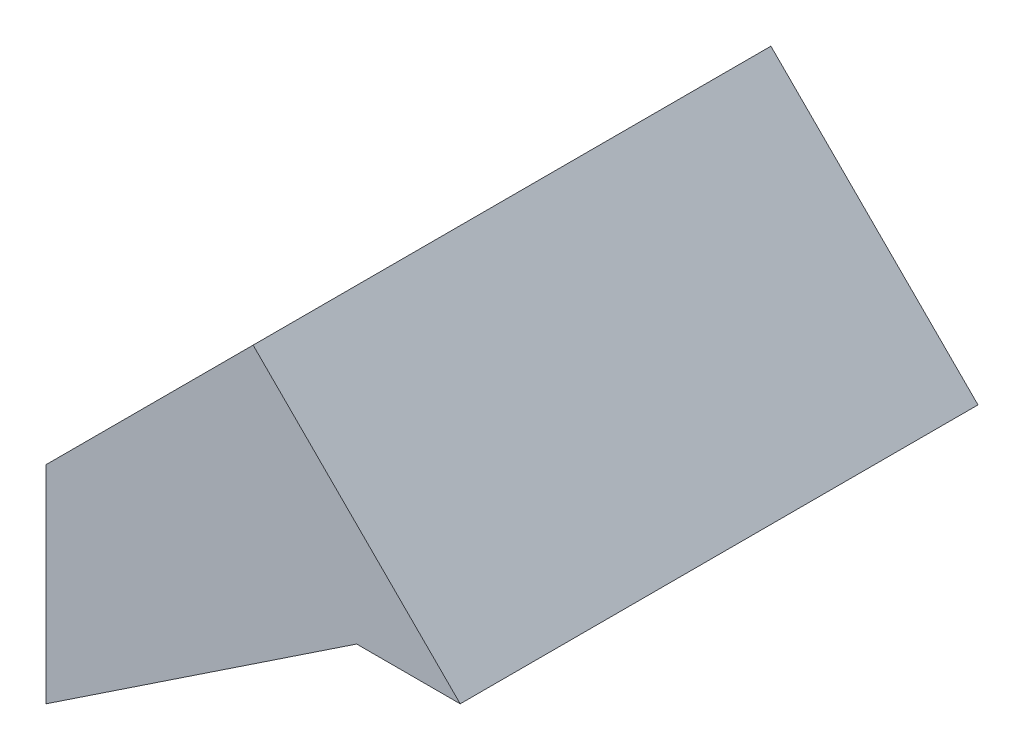
ISO-10303-21;
HEADER;
FILE_DESCRIPTION(('STEP AP214'),'2;1');
FILE_NAME('part.step','',(''),(''),'','','');
FILE_SCHEMA(('AUTOMOTIVE_DESIGN { 1 0 10303 214 1 1 1 1 }'));
ENDSEC;
DATA;
#1=APPLICATION_CONTEXT('core data for automotive mechanical design processes');
#2=APPLICATION_PROTOCOL_DEFINITION('international standard','automotive_design',2000,#1);
#3=PRODUCT_CONTEXT('',#1,'mechanical');
#4=PRODUCT('Part','Part','',(#3));
#5=PRODUCT_RELATED_PRODUCT_CATEGORY('part','',(#4));
#6=PRODUCT_DEFINITION_FORMATION('','',#4);
#7=PRODUCT_DEFINITION_CONTEXT('part definition',#1,'design');
#8=PRODUCT_DEFINITION('design','',#6,#7);
#9=PRODUCT_DEFINITION_SHAPE('','',#8);
#10=(LENGTH_UNIT() NAMED_UNIT(*) SI_UNIT(.MILLI.,.METRE.));
#11=(NAMED_UNIT(*) PLANE_ANGLE_UNIT() SI_UNIT($,.RADIAN.));
#12=(NAMED_UNIT(*) SI_UNIT($,.STERADIAN.) SOLID_ANGLE_UNIT());
#13=UNCERTAINTY_MEASURE_WITH_UNIT(LENGTH_MEASURE(1.E-05),#10,'distance_accuracy_value','');
#14=(GEOMETRIC_REPRESENTATION_CONTEXT(3) GLOBAL_UNCERTAINTY_ASSIGNED_CONTEXT((#13)) GLOBAL_UNIT_ASSIGNED_CONTEXT((#10,
#11,#12)) REPRESENTATION_CONTEXT('',''));
#15=CARTESIAN_POINT('',(0.,0.,0.));
#16=DIRECTION('',(0.,0.,1.));
#17=DIRECTION('',(1.,0.,0.));
#18=AXIS2_PLACEMENT_3D('',#15,#16,#17);
#19=CARTESIAN_POINT('',(-20.,-10.,25.));
#20=DIRECTION('',(1.,0.,0.));
#21=DIRECTION('',(0.,0.,-1.));
#22=AXIS2_PLACEMENT_3D('',#19,#20,#21);
#23=PLANE('',#22);
#24=DIRECTION('',(0.,-1.,0.));
#25=VECTOR('',#24,1.);
#26=CARTESIAN_POINT('',(-20.,-10.,0.));
#27=LINE('',#26,#25);
#28=CARTESIAN_POINT('',(-20.,0.,0.));
#29=VERTEX_POINT('',#28);
#30=CARTESIAN_POINT('',(-20.,-10.,0.));
#31=VERTEX_POINT('',#30);
#32=EDGE_CURVE('E107',#29,#31,#27,.T.);
#33=ORIENTED_EDGE('',*,*,#32,.T.);
#34=DIRECTION('',(0.,0.,-1.));
#35=VECTOR('',#34,1.);
#36=CARTESIAN_POINT('',(-20.,-10.,25.));
#37=LINE('',#36,#35);
#38=CARTESIAN_POINT('',(-20.,-10.,25.));
#39=VERTEX_POINT('',#38);
#40=EDGE_CURVE('E11',#39,#31,#37,.T.);
#41=ORIENTED_EDGE('',*,*,#40,.F.);
#42=DIRECTION('',(0.,-1.,0.));
#43=VECTOR('',#42,1.);
#44=CARTESIAN_POINT('',(-20.,-10.,25.));
#45=LINE('',#44,#43);
#46=CARTESIAN_POINT('',(-20.,0.,25.));
#47=VERTEX_POINT('',#46);
#48=EDGE_CURVE('E115',#47,#39,#45,.T.);
#49=ORIENTED_EDGE('',*,*,#48,.F.);
#50=DIRECTION('',(0.,0.,-1.));
#51=VECTOR('',#50,1.);
#52=CARTESIAN_POINT('',(-20.,0.,25.));
#53=LINE('',#52,#51);
#54=EDGE_CURVE('E103',#47,#29,#53,.T.);
#55=ORIENTED_EDGE('',*,*,#54,.T.);
#56=EDGE_LOOP('',(#33,#41,#49,#55));
#57=FACE_BOUND('',#56,.T.);
#58=ADVANCED_FACE('F33',(#57),#23,.F.);
#59=CARTESIAN_POINT('',(-5.,0.,25.));
#60=DIRECTION('',(-0.554700196225229,0.832050294337844,0.));
#61=DIRECTION('',(-0.832050294337844,-0.554700196225229,0.));
#62=AXIS2_PLACEMENT_3D('',#59,#60,#61);
#63=PLANE('',#62);
#64=DIRECTION('',(0.832050294337844,0.554700196225229,0.));
#65=VECTOR('',#64,1.);
#66=CARTESIAN_POINT('',(-5.,0.,0.));
#67=LINE('',#66,#65);
#68=CARTESIAN_POINT('',(-5.,0.,0.));
#69=VERTEX_POINT('',#68);
#70=EDGE_CURVE('E110',#31,#69,#67,.T.);
#71=ORIENTED_EDGE('',*,*,#70,.T.);
#72=DIRECTION('',(0.,0.,-1.));
#73=VECTOR('',#72,1.);
#74=CARTESIAN_POINT('',(-5.,0.,25.));
#75=LINE('',#74,#73);
#76=CARTESIAN_POINT('',(-5.,0.,25.));
#77=VERTEX_POINT('',#76);
#78=EDGE_CURVE('E41',#77,#69,#75,.T.);
#79=ORIENTED_EDGE('',*,*,#78,.F.);
#80=DIRECTION('',(0.832050294337844,0.554700196225229,0.));
#81=VECTOR('',#80,1.);
#82=CARTESIAN_POINT('',(-5.,0.,25.));
#83=LINE('',#82,#81);
#84=EDGE_CURVE('E83',#39,#77,#83,.T.);
#85=ORIENTED_EDGE('',*,*,#84,.F.);
#86=ORIENTED_EDGE('',*,*,#40,.T.);
#87=EDGE_LOOP('',(#71,#79,#85,#86));
#88=FACE_BOUND('',#87,.T.);
#89=ADVANCED_FACE('F134',(#88),#63,.F.);
#90=CARTESIAN_POINT('',(0.,0.,25.));
#91=DIRECTION('',(0.,1.,0.));
#92=DIRECTION('',(-1.,0.,0.));
#93=AXIS2_PLACEMENT_3D('',#90,#91,#92);
#94=PLANE('',#93);
#95=DIRECTION('',(1.,0.,0.));
#96=VECTOR('',#95,1.);
#97=CARTESIAN_POINT('',(0.,0.,0.));
#98=LINE('',#97,#96);
#99=CARTESIAN_POINT('',(0.,0.,0.));
#100=VERTEX_POINT('',#99);
#101=EDGE_CURVE('E98',#69,#100,#98,.T.);
#102=ORIENTED_EDGE('',*,*,#101,.T.);
#103=DIRECTION('',(0.,0.,-1.));
#104=VECTOR('',#103,1.);
#105=CARTESIAN_POINT('',(0.,0.,25.));
#106=LINE('',#105,#104);
#107=CARTESIAN_POINT('',(0.,0.,25.));
#108=VERTEX_POINT('',#107);
#109=EDGE_CURVE('E95',#108,#100,#106,.T.);
#110=ORIENTED_EDGE('',*,*,#109,.F.);
#111=DIRECTION('',(1.,0.,0.));
#112=VECTOR('',#111,1.);
#113=CARTESIAN_POINT('',(0.,0.,25.));
#114=LINE('',#113,#112);
#115=EDGE_CURVE('E87',#77,#108,#114,.T.);
#116=ORIENTED_EDGE('',*,*,#115,.F.);
#117=ORIENTED_EDGE('',*,*,#78,.T.);
#118=EDGE_LOOP('',(#102,#110,#116,#117));
#119=FACE_BOUND('',#118,.T.);
#120=ADVANCED_FACE('F96',(#119),#94,.F.);
#121=CARTESIAN_POINT('',(-10.,10.,25.));
#122=DIRECTION('',(-0.707106781186548,-0.707106781186548,0.));
#123=DIRECTION('',(0.707106781186548,-0.707106781186548,0.));
#124=AXIS2_PLACEMENT_3D('',#121,#122,#123);
#125=PLANE('',#124);
#126=DIRECTION('',(-0.707106781186548,0.707106781186548,0.));
#127=VECTOR('',#126,1.);
#128=CARTESIAN_POINT('',(-10.,10.,0.));
#129=LINE('',#128,#127);
#130=CARTESIAN_POINT('',(-10.,10.,0.));
#131=VERTEX_POINT('',#130);
#132=EDGE_CURVE('E69',#100,#131,#129,.T.);
#133=ORIENTED_EDGE('',*,*,#132,.T.);
#134=DIRECTION('',(0.,0.,-1.));
#135=VECTOR('',#134,1.);
#136=CARTESIAN_POINT('',(-10.,10.,25.));
#137=LINE('',#136,#135);
#138=CARTESIAN_POINT('',(-10.,10.,25.));
#139=VERTEX_POINT('',#138);
#140=EDGE_CURVE('E99',#139,#131,#137,.T.);
#141=ORIENTED_EDGE('',*,*,#140,.F.);
#142=DIRECTION('',(-0.707106781186548,0.707106781186548,0.));
#143=VECTOR('',#142,1.);
#144=CARTESIAN_POINT('',(-10.,10.,25.));
#145=LINE('',#144,#143);
#146=EDGE_CURVE('E91',#108,#139,#145,.T.);
#147=ORIENTED_EDGE('',*,*,#146,.F.);
#148=ORIENTED_EDGE('',*,*,#109,.T.);
#149=EDGE_LOOP('',(#133,#141,#147,#148));
#150=FACE_BOUND('',#149,.T.);
#151=ADVANCED_FACE('F101',(#150),#125,.F.);
#152=CARTESIAN_POINT('',(-20.,0.,25.));
#153=DIRECTION('',(0.707106781186548,-0.707106781186547,0.));
#154=DIRECTION('',(0.707106781186547,0.707106781186548,0.));
#155=AXIS2_PLACEMENT_3D('',#152,#153,#154);
#156=PLANE('',#155);
#157=DIRECTION('',(-0.707106781186547,-0.707106781186548,0.));
#158=VECTOR('',#157,1.);
#159=CARTESIAN_POINT('',(-20.,0.,0.));
#160=LINE('',#159,#158);
#161=EDGE_CURVE('E75',#131,#29,#160,.T.);
#162=ORIENTED_EDGE('',*,*,#161,.T.);
#163=ORIENTED_EDGE('',*,*,#54,.F.);
#164=DIRECTION('',(-0.707106781186547,-0.707106781186548,0.));
#165=VECTOR('',#164,1.);
#166=CARTESIAN_POINT('',(-20.,0.,25.));
#167=LINE('',#166,#165);
#168=EDGE_CURVE('E49',#139,#47,#167,.T.);
#169=ORIENTED_EDGE('',*,*,#168,.F.);
#170=ORIENTED_EDGE('',*,*,#140,.T.);
#171=EDGE_LOOP('',(#162,#163,#169,#170));
#172=FACE_BOUND('',#171,.T.);
#173=ADVANCED_FACE('F123',(#172),#156,.F.);
#174=CARTESIAN_POINT('',(0.,0.,25.));
#175=DIRECTION('',(0.,0.,1.));
#176=DIRECTION('',(1.,0.,0.));
#177=AXIS2_PLACEMENT_3D('',#174,#175,#176);
#178=PLANE('',#177);
#179=ORIENTED_EDGE('',*,*,#48,.T.);
#180=ORIENTED_EDGE('',*,*,#84,.T.);
#181=ORIENTED_EDGE('',*,*,#115,.T.);
#182=ORIENTED_EDGE('',*,*,#146,.T.);
#183=ORIENTED_EDGE('',*,*,#168,.T.);
#184=EDGE_LOOP('',(#179,#180,#181,#182,#183));
#185=FACE_BOUND('',#184,.T.);
#186=ADVANCED_FACE('F89',(#185),#178,.T.);
#187=CARTESIAN_POINT('',(0.,0.,0.));
#188=DIRECTION('',(0.,0.,1.));
#189=DIRECTION('',(1.,0.,0.));
#190=AXIS2_PLACEMENT_3D('',#187,#188,#189);
#191=PLANE('',#190);
#192=ORIENTED_EDGE('',*,*,#32,.F.);
#193=ORIENTED_EDGE('',*,*,#161,.F.);
#194=ORIENTED_EDGE('',*,*,#132,.F.);
#195=ORIENTED_EDGE('',*,*,#101,.F.);
#196=ORIENTED_EDGE('',*,*,#70,.F.);
#197=EDGE_LOOP('',(#192,#193,#194,#195,#196));
#198=FACE_BOUND('',#197,.T.);
#199=ADVANCED_FACE('F119',(#198),#191,.F.);
#200=CLOSED_SHELL('',(#58,#89,#120,#151,#173,#186,#199));
#201=MANIFOLD_SOLID_BREP('B2',#200);
#202=ADVANCED_BREP_SHAPE_REPRESENTATION('',(#18,#201),#14);
#203=SHAPE_DEFINITION_REPRESENTATION(#9,#202);
ENDSEC;
END-ISO-10303-21;
